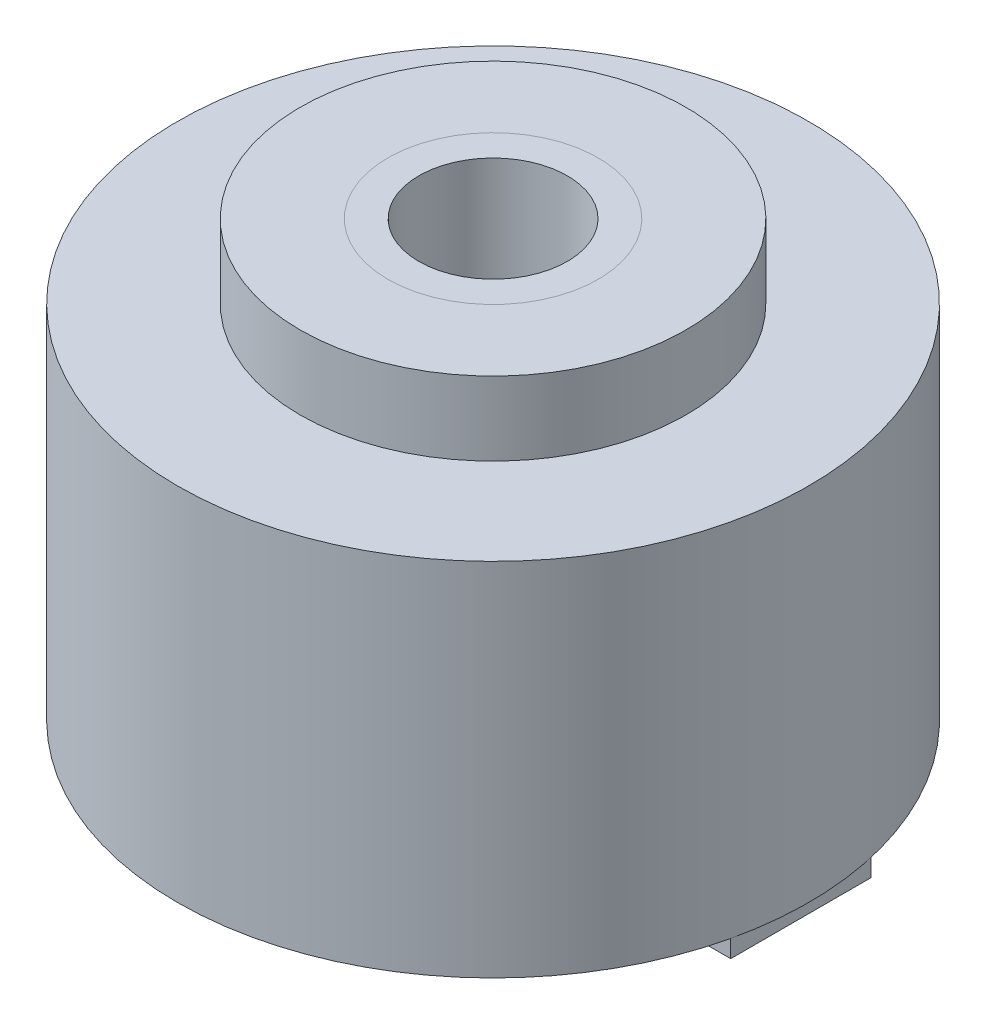
ISO-10303-21;
HEADER;
FILE_DESCRIPTION(('STEP AP214'),'2;1');
FILE_NAME('part.step','',(''),(''),'','','');
FILE_SCHEMA(('AUTOMOTIVE_DESIGN { 1 0 10303 214 1 1 1 1 }'));
ENDSEC;
DATA;
#1=APPLICATION_CONTEXT('core data for automotive mechanical design processes');
#2=APPLICATION_PROTOCOL_DEFINITION('international standard','automotive_design',2000,#1);
#3=PRODUCT_CONTEXT('',#1,'mechanical');
#4=PRODUCT('Part','Part','',(#3));
#5=PRODUCT_RELATED_PRODUCT_CATEGORY('part','',(#4));
#6=PRODUCT_DEFINITION_FORMATION('','',#4);
#7=PRODUCT_DEFINITION_CONTEXT('part definition',#1,'design');
#8=PRODUCT_DEFINITION('design','',#6,#7);
#9=PRODUCT_DEFINITION_SHAPE('','',#8);
#10=(LENGTH_UNIT() NAMED_UNIT(*) SI_UNIT(.MILLI.,.METRE.));
#11=(NAMED_UNIT(*) PLANE_ANGLE_UNIT() SI_UNIT($,.RADIAN.));
#12=(NAMED_UNIT(*) SI_UNIT($,.STERADIAN.) SOLID_ANGLE_UNIT());
#13=UNCERTAINTY_MEASURE_WITH_UNIT(LENGTH_MEASURE(1.E-05),#10,'distance_accuracy_value','');
#14=(GEOMETRIC_REPRESENTATION_CONTEXT(3) GLOBAL_UNCERTAINTY_ASSIGNED_CONTEXT((#13)) GLOBAL_UNIT_ASSIGNED_CONTEXT((#10,
#11,#12)) REPRESENTATION_CONTEXT('',''));
#15=CARTESIAN_POINT('',(0.,0.,0.));
#16=DIRECTION('',(0.,0.,1.));
#17=DIRECTION('',(1.,0.,0.));
#18=AXIS2_PLACEMENT_3D('',#15,#16,#17);
#19=CARTESIAN_POINT('',(26.3248931621764,-1.5,6.));
#20=DIRECTION('',(0.,0.,-1.));
#21=DIRECTION('',(-1.,0.,0.));
#22=AXIS2_PLACEMENT_3D('',#19,#20,#21);
#23=PLANE('',#22);
#24=DIRECTION('',(-1.,0.,0.));
#25=VECTOR('',#24,1.);
#26=CARTESIAN_POINT('',(26.3248931621764,0.,6.));
#27=LINE('',#26,#25);
#28=CARTESIAN_POINT('',(26.3248931621764,0.,6.));
#29=VERTEX_POINT('',#28);
#30=CARTESIAN_POINT('',(9.17989316217636,0.,6.));
#31=VERTEX_POINT('',#30);
#32=EDGE_CURVE('E133',#29,#31,#27,.T.);
#33=ORIENTED_EDGE('',*,*,#32,.T.);
#34=DIRECTION('',(0.,1.,0.));
#35=VECTOR('',#34,1.);
#36=CARTESIAN_POINT('',(9.17989316217636,-1.5,6.));
#37=LINE('',#36,#35);
#38=CARTESIAN_POINT('',(9.17989316217636,-1.5,6.));
#39=VERTEX_POINT('',#38);
#40=EDGE_CURVE('E12',#39,#31,#37,.T.);
#41=ORIENTED_EDGE('',*,*,#40,.F.);
#42=DIRECTION('',(-1.,0.,0.));
#43=VECTOR('',#42,1.);
#44=CARTESIAN_POINT('',(26.3248931621764,-1.5,6.));
#45=LINE('',#44,#43);
#46=CARTESIAN_POINT('',(26.3248931621764,-1.5,6.));
#47=VERTEX_POINT('',#46);
#48=EDGE_CURVE('E143',#47,#39,#45,.T.);
#49=ORIENTED_EDGE('',*,*,#48,.F.);
#50=DIRECTION('',(0.,1.,0.));
#51=VECTOR('',#50,1.);
#52=CARTESIAN_POINT('',(26.3248931621764,-1.5,6.));
#53=LINE('',#52,#51);
#54=EDGE_CURVE('E129',#47,#29,#53,.T.);
#55=ORIENTED_EDGE('',*,*,#54,.T.);
#56=EDGE_LOOP('',(#33,#41,#49,#55));
#57=FACE_BOUND('',#56,.T.);
#58=ADVANCED_FACE('F49',(#57),#23,.F.);
#59=CARTESIAN_POINT('',(9.17989316217636,-1.5,6.));
#60=DIRECTION('',(1.,0.,0.));
#61=DIRECTION('',(0.,0.,-1.));
#62=AXIS2_PLACEMENT_3D('',#59,#60,#61);
#63=PLANE('',#62);
#64=DIRECTION('',(0.,0.,-1.));
#65=VECTOR('',#64,1.);
#66=CARTESIAN_POINT('',(9.17989316217636,0.,6.));
#67=LINE('',#66,#65);
#68=CARTESIAN_POINT('',(9.17989316217636,0.,2.99999999999999));
#69=VERTEX_POINT('',#68);
#70=EDGE_CURVE('E136',#31,#69,#67,.T.);
#71=ORIENTED_EDGE('',*,*,#70,.T.);
#72=DIRECTION('',(0.,1.,0.));
#73=VECTOR('',#72,1.);
#74=CARTESIAN_POINT('',(9.17989316217636,-1.5,2.99999999999999));
#75=LINE('',#74,#73);
#76=CARTESIAN_POINT('',(9.17989316217636,-1.5,2.99999999999999));
#77=VERTEX_POINT('',#76);
#78=EDGE_CURVE('E57',#77,#69,#75,.T.);
#79=ORIENTED_EDGE('',*,*,#78,.F.);
#80=DIRECTION('',(0.,0.,-1.));
#81=VECTOR('',#80,1.);
#82=CARTESIAN_POINT('',(9.17989316217636,-1.5,6.));
#83=LINE('',#82,#81);
#84=EDGE_CURVE('E102',#39,#77,#83,.T.);
#85=ORIENTED_EDGE('',*,*,#84,.F.);
#86=ORIENTED_EDGE('',*,*,#40,.T.);
#87=EDGE_LOOP('',(#71,#79,#85,#86));
#88=FACE_BOUND('',#87,.T.);
#89=ADVANCED_FACE('F167',(#88),#63,.F.);
#90=CARTESIAN_POINT('',(9.17989316217636,-1.5,0.));
#91=DIRECTION('',(0.,1.,0.));
#92=DIRECTION('',(0.,0.,1.));
#93=AXIS2_PLACEMENT_3D('',#90,#91,#92);
#94=CYLINDRICAL_SURFACE('',#93,3.);
#95=CARTESIAN_POINT('',(9.17989316217636,0.,0.));
#96=DIRECTION('',(0.,1.,0.));
#97=DIRECTION('',(0.,0.,1.));
#98=AXIS2_PLACEMENT_3D('',#95,#96,#97);
#99=CIRCLE('',#98,3.);
#100=CARTESIAN_POINT('',(9.17989316217636,0.,-3.));
#101=VERTEX_POINT('',#100);
#102=EDGE_CURVE('E138',#69,#101,#99,.T.);
#103=ORIENTED_EDGE('',*,*,#102,.T.);
#104=DIRECTION('',(0.,1.,0.));
#105=VECTOR('',#104,1.);
#106=CARTESIAN_POINT('',(9.17989316217636,-1.5,-3.));
#107=LINE('',#106,#105);
#108=CARTESIAN_POINT('',(9.17989316217636,-1.5,-3.));
#109=VERTEX_POINT('',#108);
#110=EDGE_CURVE('E124',#109,#101,#107,.T.);
#111=ORIENTED_EDGE('',*,*,#110,.F.);
#112=CARTESIAN_POINT('',(9.17989316217636,-1.5,0.));
#113=DIRECTION('',(0.,1.,0.));
#114=DIRECTION('',(0.,0.,1.));
#115=AXIS2_PLACEMENT_3D('',#112,#113,#114);
#116=CIRCLE('',#115,3.);
#117=EDGE_CURVE('E115',#77,#109,#116,.T.);
#118=ORIENTED_EDGE('',*,*,#117,.F.);
#119=ORIENTED_EDGE('',*,*,#78,.T.);
#120=EDGE_LOOP('',(#103,#111,#118,#119));
#121=FACE_BOUND('',#120,.T.);
#122=ADVANCED_FACE('F149',(#121),#94,.F.);
#123=CARTESIAN_POINT('',(9.17989316217636,-1.5,-6.));
#124=DIRECTION('',(1.,0.,0.));
#125=DIRECTION('',(0.,0.,-1.));
#126=AXIS2_PLACEMENT_3D('',#123,#124,#125);
#127=PLANE('',#126);
#128=DIRECTION('',(0.,0.,-1.));
#129=VECTOR('',#128,1.);
#130=CARTESIAN_POINT('',(9.17989316217636,0.,-6.));
#131=LINE('',#130,#129);
#132=CARTESIAN_POINT('',(9.17989316217636,0.,-6.));
#133=VERTEX_POINT('',#132);
#134=EDGE_CURVE('E123',#101,#133,#131,.T.);
#135=ORIENTED_EDGE('',*,*,#134,.T.);
#136=DIRECTION('',(0.,1.,0.));
#137=VECTOR('',#136,1.);
#138=CARTESIAN_POINT('',(9.17989316217636,-1.5,-6.));
#139=LINE('',#138,#137);
#140=CARTESIAN_POINT('',(9.17989316217636,-1.5,-6.));
#141=VERTEX_POINT('',#140);
#142=EDGE_CURVE('E120',#141,#133,#139,.T.);
#143=ORIENTED_EDGE('',*,*,#142,.F.);
#144=DIRECTION('',(0.,0.,-1.));
#145=VECTOR('',#144,1.);
#146=CARTESIAN_POINT('',(9.17989316217636,-1.5,-6.));
#147=LINE('',#146,#145);
#148=EDGE_CURVE('E109',#109,#141,#147,.T.);
#149=ORIENTED_EDGE('',*,*,#148,.F.);
#150=ORIENTED_EDGE('',*,*,#110,.T.);
#151=EDGE_LOOP('',(#135,#143,#149,#150));
#152=FACE_BOUND('',#151,.T.);
#153=ADVANCED_FACE('F121',(#152),#127,.F.);
#154=CARTESIAN_POINT('',(26.3248931621764,-1.5,-6.));
#155=DIRECTION('',(0.,0.,1.));
#156=DIRECTION('',(1.,0.,0.));
#157=AXIS2_PLACEMENT_3D('',#154,#155,#156);
#158=PLANE('',#157);
#159=DIRECTION('',(1.,0.,0.));
#160=VECTOR('',#159,1.);
#161=CARTESIAN_POINT('',(26.3248931621764,0.,-6.));
#162=LINE('',#161,#160);
#163=CARTESIAN_POINT('',(26.3248931621764,0.,-6.));
#164=VERTEX_POINT('',#163);
#165=EDGE_CURVE('E88',#133,#164,#162,.T.);
#166=ORIENTED_EDGE('',*,*,#165,.T.);
#167=DIRECTION('',(0.,1.,0.));
#168=VECTOR('',#167,1.);
#169=CARTESIAN_POINT('',(26.3248931621764,-1.5,-6.));
#170=LINE('',#169,#168);
#171=CARTESIAN_POINT('',(26.3248931621764,-1.5,-6.));
#172=VERTEX_POINT('',#171);
#173=EDGE_CURVE('E125',#172,#164,#170,.T.);
#174=ORIENTED_EDGE('',*,*,#173,.F.);
#175=DIRECTION('',(1.,0.,0.));
#176=VECTOR('',#175,1.);
#177=CARTESIAN_POINT('',(26.3248931621764,-1.5,-6.));
#178=LINE('',#177,#176);
#179=EDGE_CURVE('E113',#141,#172,#178,.T.);
#180=ORIENTED_EDGE('',*,*,#179,.F.);
#181=ORIENTED_EDGE('',*,*,#142,.T.);
#182=EDGE_LOOP('',(#166,#174,#180,#181));
#183=FACE_BOUND('',#182,.T.);
#184=ADVANCED_FACE('F127',(#183),#158,.F.);
#185=CARTESIAN_POINT('',(26.3248931621764,-1.5,-6.));
#186=DIRECTION('',(-1.,0.,0.));
#187=DIRECTION('',(0.,0.,1.));
#188=AXIS2_PLACEMENT_3D('',#185,#186,#187);
#189=PLANE('',#188);
#190=DIRECTION('',(0.,0.,1.));
#191=VECTOR('',#190,1.);
#192=CARTESIAN_POINT('',(26.3248931621764,0.,-6.));
#193=LINE('',#192,#191);
#194=EDGE_CURVE('E94',#164,#29,#193,.T.);
#195=ORIENTED_EDGE('',*,*,#194,.T.);
#196=ORIENTED_EDGE('',*,*,#54,.F.);
#197=DIRECTION('',(0.,0.,1.));
#198=VECTOR('',#197,1.);
#199=CARTESIAN_POINT('',(26.3248931621764,-1.5,-6.));
#200=LINE('',#199,#198);
#201=EDGE_CURVE('E65',#172,#47,#200,.T.);
#202=ORIENTED_EDGE('',*,*,#201,.F.);
#203=ORIENTED_EDGE('',*,*,#173,.T.);
#204=EDGE_LOOP('',(#195,#196,#202,#203));
#205=FACE_BOUND('',#204,.T.);
#206=ADVANCED_FACE('F156',(#205),#189,.F.);
#207=CARTESIAN_POINT('',(9.17989316217636,-1.5,0.));
#208=DIRECTION('',(0.,1.,0.));
#209=DIRECTION('',(0.,0.,1.));
#210=AXIS2_PLACEMENT_3D('',#207,#208,#209);
#211=PLANE('',#210);
#212=ORIENTED_EDGE('',*,*,#48,.T.);
#213=ORIENTED_EDGE('',*,*,#84,.T.);
#214=ORIENTED_EDGE('',*,*,#117,.T.);
#215=ORIENTED_EDGE('',*,*,#148,.T.);
#216=ORIENTED_EDGE('',*,*,#179,.T.);
#217=ORIENTED_EDGE('',*,*,#201,.T.);
#218=EDGE_LOOP('',(#212,#213,#214,#215,#216,#217));
#219=FACE_BOUND('',#218,.T.);
#220=ADVANCED_FACE('F111',(#219),#211,.F.);
#221=CARTESIAN_POINT('',(9.17989316217636,0.,0.));
#222=DIRECTION('',(0.,1.,0.));
#223=DIRECTION('',(0.,0.,1.));
#224=AXIS2_PLACEMENT_3D('',#221,#222,#223);
#225=PLANE('',#224);
#226=ORIENTED_EDGE('',*,*,#32,.F.);
#227=ORIENTED_EDGE('',*,*,#194,.F.);
#228=ORIENTED_EDGE('',*,*,#165,.F.);
#229=ORIENTED_EDGE('',*,*,#134,.F.);
#230=ORIENTED_EDGE('',*,*,#102,.F.);
#231=ORIENTED_EDGE('',*,*,#70,.F.);
#232=EDGE_LOOP('',(#226,#227,#228,#229,#230,#231));
#233=FACE_BOUND('',#232,.T.);
#234=ADVANCED_FACE('F152',(#233),#225,.T.);
#235=CLOSED_SHELL('',(#58,#89,#122,#153,#184,#206,#220,#234));
#236=MANIFOLD_SOLID_BREP('B2',#235);
#237=CARTESIAN_POINT('',(0.,62.6168441227157,0.));
#238=DIRECTION('',(0.,-1.,0.));
#239=DIRECTION('',(0.,0.,-1.));
#240=AXIS2_PLACEMENT_3D('',#237,#238,#239);
#241=CYLINDRICAL_SURFACE('',#240,9.);
#242=CARTESIAN_POINT('',(0.,37.161,0.));
#243=DIRECTION('',(0.,1.,0.));
#244=DIRECTION('',(0.,0.,1.));
#245=AXIS2_PLACEMENT_3D('',#242,#243,#244);
#246=CIRCLE('',#245,9.);
#247=CARTESIAN_POINT('',(0.,37.161,9.));
#248=VERTEX_POINT('',#247);
#249=EDGE_CURVE('E48',#248,#248,#246,.T.);
#250=ORIENTED_EDGE('',*,*,#249,.F.);
#251=EDGE_LOOP('',(#250));
#252=FACE_BOUND('',#251,.T.);
#253=CARTESIAN_POINT('',(0.,-1.,0.));
#254=DIRECTION('',(0.,1.,0.));
#255=DIRECTION('',(0.,0.,1.));
#256=AXIS2_PLACEMENT_3D('',#253,#254,#255);
#257=CIRCLE('',#256,9.);
#258=CARTESIAN_POINT('',(0.,-1.,9.));
#259=VERTEX_POINT('',#258);
#260=EDGE_CURVE('E239',#259,#259,#257,.F.);
#261=ORIENTED_EDGE('',*,*,#260,.F.);
#262=EDGE_LOOP('',(#261));
#263=FACE_BOUND('',#262,.T.);
#264=ADVANCED_FACE('F232',(#252,#263),#241,.T.);
#265=CARTESIAN_POINT('',(0.,37.161,0.));
#266=DIRECTION('',(0.,1.,0.));
#267=DIRECTION('',(0.,0.,1.));
#268=AXIS2_PLACEMENT_3D('',#265,#266,#267);
#269=PLANE('',#268);
#270=CARTESIAN_POINT('',(0.,37.161,0.));
#271=DIRECTION('',(0.,1.,0.));
#272=DIRECTION('',(0.,0.,1.));
#273=AXIS2_PLACEMENT_3D('',#270,#271,#272);
#274=CIRCLE('',#273,6.35);
#275=CARTESIAN_POINT('',(0.,37.161,6.35));
#276=VERTEX_POINT('',#275);
#277=EDGE_CURVE('E247',#276,#276,#274,.T.);
#278=ORIENTED_EDGE('',*,*,#277,.F.);
#279=EDGE_LOOP('',(#278));
#280=FACE_BOUND('',#279,.T.);
#281=ORIENTED_EDGE('',*,*,#249,.T.);
#282=EDGE_LOOP('',(#281));
#283=FACE_BOUND('',#282,.T.);
#284=ADVANCED_FACE('F234',(#280,#283),#269,.T.);
#285=CARTESIAN_POINT('',(0.,-1.,0.));
#286=DIRECTION('',(0.,1.,0.));
#287=DIRECTION('',(0.,0.,1.));
#288=AXIS2_PLACEMENT_3D('',#285,#286,#287);
#289=PLANE('',#288);
#290=CARTESIAN_POINT('',(0.,-1.,0.));
#291=DIRECTION('',(0.,1.,0.));
#292=DIRECTION('',(0.,0.,1.));
#293=AXIS2_PLACEMENT_3D('',#290,#291,#292);
#294=CIRCLE('',#293,6.35);
#295=CARTESIAN_POINT('',(0.,-1.,6.35));
#296=VERTEX_POINT('',#295);
#297=EDGE_CURVE('E243',#296,#296,#294,.T.);
#298=ORIENTED_EDGE('',*,*,#297,.T.);
#299=EDGE_LOOP('',(#298));
#300=FACE_BOUND('',#299,.T.);
#301=ORIENTED_EDGE('',*,*,#260,.T.);
#302=EDGE_LOOP('',(#301));
#303=FACE_BOUND('',#302,.T.);
#304=ADVANCED_FACE('F256',(#300,#303),#289,.F.);
#305=CARTESIAN_POINT('',(0.,-1.,0.));
#306=DIRECTION('',(0.,1.,0.));
#307=DIRECTION('',(0.,0.,1.));
#308=AXIS2_PLACEMENT_3D('',#305,#306,#307);
#309=CYLINDRICAL_SURFACE('',#308,6.35);
#310=ORIENTED_EDGE('',*,*,#297,.F.);
#311=EDGE_LOOP('',(#310));
#312=FACE_BOUND('',#311,.T.);
#313=ORIENTED_EDGE('',*,*,#277,.T.);
#314=EDGE_LOOP('',(#313));
#315=FACE_BOUND('',#314,.T.);
#316=ADVANCED_FACE('F253',(#312,#315),#309,.F.);
#317=CLOSED_SHELL('',(#264,#284,#304,#316));
#318=MANIFOLD_SOLID_BREP('B6',#317);
#319=CARTESIAN_POINT('',(0.,30.861,0.));
#320=DIRECTION('',(0.,1.,0.));
#321=DIRECTION('',(0.,0.,1.));
#322=AXIS2_PLACEMENT_3D('',#319,#320,#321);
#323=PLANE('',#322);
#324=CARTESIAN_POINT('',(0.,30.861,0.));
#325=DIRECTION('',(0.,1.,0.));
#326=DIRECTION('',(0.,0.,1.));
#327=AXIS2_PLACEMENT_3D('',#324,#325,#326);
#328=CIRCLE('',#327,6.35);
#329=CARTESIAN_POINT('',(0.,30.861,6.35));
#330=VERTEX_POINT('',#329);
#331=EDGE_CURVE('E327',#330,#330,#328,.T.);
#332=ORIENTED_EDGE('',*,*,#331,.F.);
#333=EDGE_LOOP('',(#332));
#334=FACE_BOUND('',#333,.T.);
#335=CARTESIAN_POINT('',(0.,30.861,0.));
#336=DIRECTION('',(0.,1.,0.));
#337=DIRECTION('',(0.,0.,1.));
#338=AXIS2_PLACEMENT_3D('',#335,#336,#337);
#339=CIRCLE('',#338,9.);
#340=CARTESIAN_POINT('',(0.,30.861,9.));
#341=VERTEX_POINT('',#340);
#342=EDGE_CURVE('E231',#341,#341,#339,.F.);
#343=ORIENTED_EDGE('',*,*,#342,.F.);
#344=EDGE_LOOP('',(#343));
#345=FACE_BOUND('',#344,.T.);
#346=ADVANCED_FACE('F311',(#334,#345),#323,.T.);
#347=CARTESIAN_POINT('',(0.,30.861,0.));
#348=DIRECTION('',(0.,1.,0.));
#349=DIRECTION('',(0.,0.,1.));
#350=AXIS2_PLACEMENT_3D('',#347,#348,#349);
#351=CIRCLE('',#350,16.5);
#352=CARTESIAN_POINT('',(0.,30.861,16.5));
#353=VERTEX_POINT('',#352);
#354=EDGE_CURVE('E335',#353,#353,#351,.T.);
#355=ORIENTED_EDGE('',*,*,#354,.F.);
#356=EDGE_LOOP('',(#355));
#357=FACE_BOUND('',#356,.T.);
#358=CARTESIAN_POINT('',(0.,30.861,0.));
#359=DIRECTION('',(0.,1.,0.));
#360=DIRECTION('',(0.,0.,1.));
#361=AXIS2_PLACEMENT_3D('',#358,#359,#360);
#362=CIRCLE('',#361,27.);
#363=CARTESIAN_POINT('',(0.,30.861,27.));
#364=VERTEX_POINT('',#363);
#365=EDGE_CURVE('E318',#364,#364,#362,.T.);
#366=ORIENTED_EDGE('',*,*,#365,.T.);
#367=EDGE_LOOP('',(#366));
#368=FACE_BOUND('',#367,.T.);
#369=ADVANCED_FACE('F362',(#357,#368),#323,.T.);
#370=CARTESIAN_POINT('',(0.,0.,0.));
#371=DIRECTION('',(0.,1.,0.));
#372=DIRECTION('',(0.,0.,1.));
#373=AXIS2_PLACEMENT_3D('',#370,#371,#372);
#374=PLANE('',#373);
#375=CARTESIAN_POINT('',(0.,0.,0.));
#376=DIRECTION('',(0.,1.,0.));
#377=DIRECTION('',(0.,0.,1.));
#378=AXIS2_PLACEMENT_3D('',#375,#376,#377);
#379=CIRCLE('',#378,27.);
#380=CARTESIAN_POINT('',(0.,0.,27.));
#381=VERTEX_POINT('',#380);
#382=EDGE_CURVE('E322',#381,#381,#379,.T.);
#383=ORIENTED_EDGE('',*,*,#382,.F.);
#384=EDGE_LOOP('',(#383));
#385=FACE_BOUND('',#384,.T.);
#386=CARTESIAN_POINT('',(0.,0.,0.));
#387=DIRECTION('',(0.,1.,0.));
#388=DIRECTION('',(0.,0.,1.));
#389=AXIS2_PLACEMENT_3D('',#386,#387,#388);
#390=CIRCLE('',#389,6.35);
#391=CARTESIAN_POINT('',(0.,0.,6.35));
#392=VERTEX_POINT('',#391);
#393=EDGE_CURVE('E329',#392,#392,#390,.T.);
#394=ORIENTED_EDGE('',*,*,#393,.T.);
#395=EDGE_LOOP('',(#394));
#396=FACE_BOUND('',#395,.T.);
#397=ADVANCED_FACE('F368',(#385,#396),#374,.F.);
#398=CARTESIAN_POINT('',(0.,30.861,0.));
#399=DIRECTION('',(0.,-1.,0.));
#400=DIRECTION('',(0.,0.,-1.));
#401=AXIS2_PLACEMENT_3D('',#398,#399,#400);
#402=CYLINDRICAL_SURFACE('',#401,27.);
#403=ORIENTED_EDGE('',*,*,#365,.F.);
#404=EDGE_LOOP('',(#403));
#405=FACE_BOUND('',#404,.T.);
#406=ORIENTED_EDGE('',*,*,#382,.T.);
#407=EDGE_LOOP('',(#406));
#408=FACE_BOUND('',#407,.T.);
#409=ADVANCED_FACE('F313',(#405,#408),#402,.T.);
#410=CARTESIAN_POINT('',(0.,30.861,0.));
#411=DIRECTION('',(0.,-1.,0.));
#412=DIRECTION('',(0.,0.,-1.));
#413=AXIS2_PLACEMENT_3D('',#410,#411,#412);
#414=CYLINDRICAL_SURFACE('',#413,6.35);
#415=ORIENTED_EDGE('',*,*,#331,.T.);
#416=EDGE_LOOP('',(#415));
#417=FACE_BOUND('',#416,.T.);
#418=ORIENTED_EDGE('',*,*,#393,.F.);
#419=EDGE_LOOP('',(#418));
#420=FACE_BOUND('',#419,.T.);
#421=ADVANCED_FACE('F349',(#417,#420),#414,.F.);
#422=CARTESIAN_POINT('',(0.,37.161,0.));
#423=DIRECTION('',(0.,1.,0.));
#424=DIRECTION('',(0.,0.,1.));
#425=AXIS2_PLACEMENT_3D('',#422,#423,#424);
#426=PLANE('',#425);
#427=CARTESIAN_POINT('',(0.,37.161,0.));
#428=DIRECTION('',(0.,1.,0.));
#429=DIRECTION('',(0.,0.,1.));
#430=AXIS2_PLACEMENT_3D('',#427,#428,#429);
#431=CIRCLE('',#430,16.5);
#432=CARTESIAN_POINT('',(0.,37.161,16.5));
#433=VERTEX_POINT('',#432);
#434=EDGE_CURVE('E332',#433,#433,#431,.T.);
#435=ORIENTED_EDGE('',*,*,#434,.T.);
#436=EDGE_LOOP('',(#435));
#437=FACE_BOUND('',#436,.T.);
#438=CARTESIAN_POINT('',(0.,37.161,0.));
#439=DIRECTION('',(0.,1.,0.));
#440=DIRECTION('',(0.,0.,1.));
#441=AXIS2_PLACEMENT_3D('',#438,#439,#440);
#442=CIRCLE('',#441,9.);
#443=CARTESIAN_POINT('',(0.,37.161,9.));
#444=VERTEX_POINT('',#443);
#445=EDGE_CURVE('E338',#444,#444,#442,.T.);
#446=ORIENTED_EDGE('',*,*,#445,.F.);
#447=EDGE_LOOP('',(#446));
#448=FACE_BOUND('',#447,.T.);
#449=ADVANCED_FACE('F346',(#437,#448),#426,.T.);
#450=CARTESIAN_POINT('',(0.,37.161,0.));
#451=DIRECTION('',(0.,-1.,0.));
#452=DIRECTION('',(0.,0.,-1.));
#453=AXIS2_PLACEMENT_3D('',#450,#451,#452);
#454=CYLINDRICAL_SURFACE('',#453,16.5);
#455=ORIENTED_EDGE('',*,*,#434,.F.);
#456=EDGE_LOOP('',(#455));
#457=FACE_BOUND('',#456,.T.);
#458=ORIENTED_EDGE('',*,*,#354,.T.);
#459=EDGE_LOOP('',(#458));
#460=FACE_BOUND('',#459,.T.);
#461=ADVANCED_FACE('F348',(#457,#460),#454,.T.);
#462=CARTESIAN_POINT('',(0.,37.161,0.));
#463=DIRECTION('',(0.,-1.,0.));
#464=DIRECTION('',(0.,0.,-1.));
#465=AXIS2_PLACEMENT_3D('',#462,#463,#464);
#466=CYLINDRICAL_SURFACE('',#465,9.);
#467=ORIENTED_EDGE('',*,*,#445,.T.);
#468=EDGE_LOOP('',(#467));
#469=FACE_BOUND('',#468,.T.);
#470=ORIENTED_EDGE('',*,*,#342,.T.);
#471=EDGE_LOOP('',(#470));
#472=FACE_BOUND('',#471,.T.);
#473=ADVANCED_FACE('F344',(#469,#472),#466,.F.);
#474=CLOSED_SHELL('',(#346,#369,#397,#409,#421,#449,#461,#473));
#475=MANIFOLD_SOLID_BREP('B43',#474);
#476=ADVANCED_BREP_SHAPE_REPRESENTATION('',(#18,#236,#318,#475),#14);
#477=SHAPE_DEFINITION_REPRESENTATION(#9,#476);
ENDSEC;
END-ISO-10303-21;
